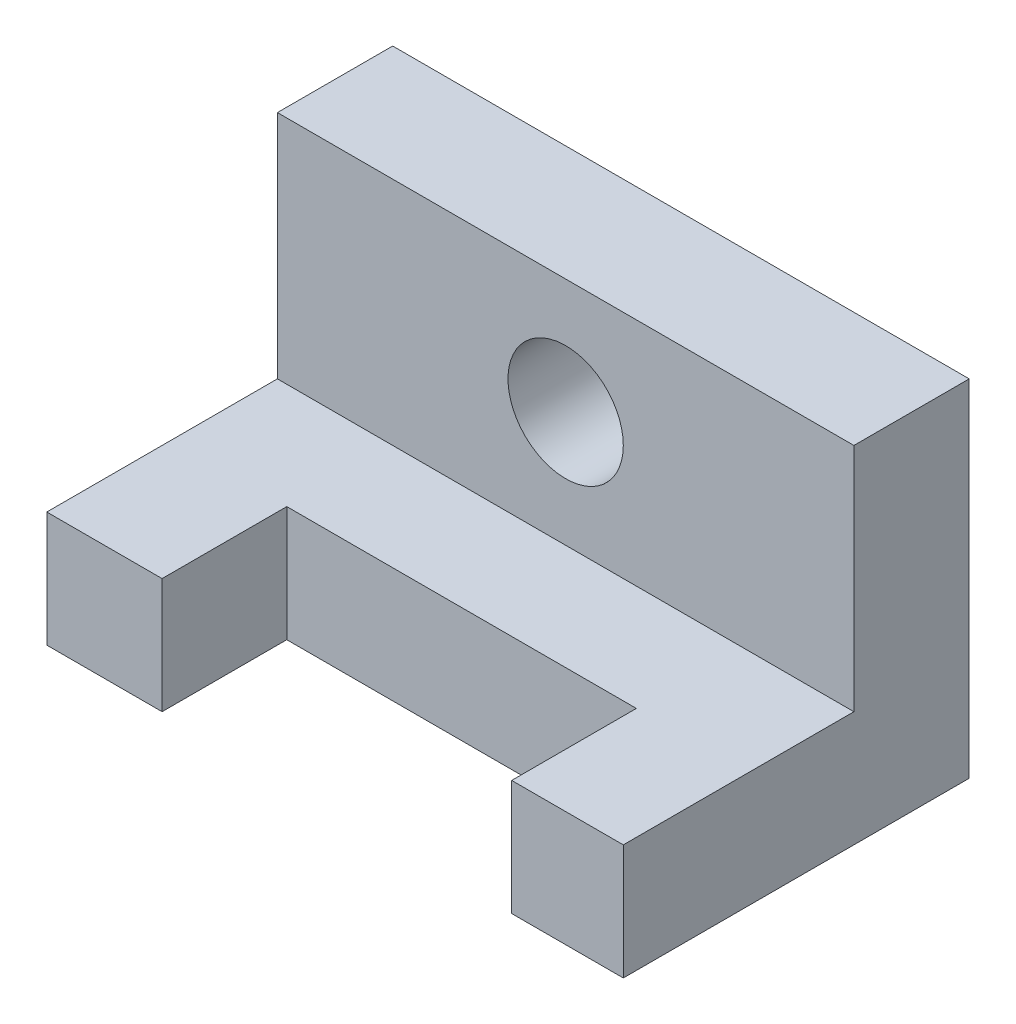
ISO-10303-21;
HEADER;
FILE_DESCRIPTION(('STEP AP214'),'2;1');
FILE_NAME('part.step','',(''),(''),'','','');
FILE_SCHEMA(('AUTOMOTIVE_DESIGN { 1 0 10303 214 1 1 1 1 }'));
ENDSEC;
DATA;
#1=APPLICATION_CONTEXT('core data for automotive mechanical design processes');
#2=APPLICATION_PROTOCOL_DEFINITION('international standard','automotive_design',2000,#1);
#3=PRODUCT_CONTEXT('',#1,'mechanical');
#4=PRODUCT('Part','Part','',(#3));
#5=PRODUCT_RELATED_PRODUCT_CATEGORY('part','',(#4));
#6=PRODUCT_DEFINITION_FORMATION('','',#4);
#7=PRODUCT_DEFINITION_CONTEXT('part definition',#1,'design');
#8=PRODUCT_DEFINITION('design','',#6,#7);
#9=PRODUCT_DEFINITION_SHAPE('','',#8);
#10=(LENGTH_UNIT() NAMED_UNIT(*) SI_UNIT(.MILLI.,.METRE.));
#11=(NAMED_UNIT(*) PLANE_ANGLE_UNIT() SI_UNIT($,.RADIAN.));
#12=(NAMED_UNIT(*) SI_UNIT($,.STERADIAN.) SOLID_ANGLE_UNIT());
#13=UNCERTAINTY_MEASURE_WITH_UNIT(LENGTH_MEASURE(1.E-05),#10,'distance_accuracy_value','');
#14=(GEOMETRIC_REPRESENTATION_CONTEXT(3) GLOBAL_UNCERTAINTY_ASSIGNED_CONTEXT((#13)) GLOBAL_UNIT_ASSIGNED_CONTEXT((#10,
#11,#12)) REPRESENTATION_CONTEXT('',''));
#15=CARTESIAN_POINT('',(0.,0.,0.));
#16=DIRECTION('',(0.,0.,1.));
#17=DIRECTION('',(1.,0.,0.));
#18=AXIS2_PLACEMENT_3D('',#15,#16,#17);
#19=CARTESIAN_POINT('',(2540.,508.,1524.));
#20=DIRECTION('',(0.,-1.,0.));
#21=DIRECTION('',(0.,0.,-1.));
#22=AXIS2_PLACEMENT_3D('',#19,#20,#21);
#23=PLANE('',#22);
#24=DIRECTION('',(0.,0.,1.));
#25=VECTOR('',#24,1.);
#26=CARTESIAN_POINT('',(508.,508.,974.657047921594));
#27=LINE('',#26,#25);
#28=CARTESIAN_POINT('',(508.,508.,974.657047921594));
#29=VERTEX_POINT('',#28);
#30=CARTESIAN_POINT('',(508.,508.,1524.));
#31=VERTEX_POINT('',#30);
#32=EDGE_CURVE('E170',#29,#31,#27,.T.);
#33=ORIENTED_EDGE('',*,*,#32,.F.);
#34=DIRECTION('',(-1.,0.,0.));
#35=VECTOR('',#34,1.);
#36=CARTESIAN_POINT('',(508.,508.,974.657047921594));
#37=LINE('',#36,#35);
#38=CARTESIAN_POINT('',(2048.2343030322,508.,974.657047921594));
#39=VERTEX_POINT('',#38);
#40=EDGE_CURVE('E239',#39,#29,#37,.T.);
#41=ORIENTED_EDGE('',*,*,#40,.F.);
#42=DIRECTION('',(0.,0.,-1.));
#43=VECTOR('',#42,1.);
#44=CARTESIAN_POINT('',(2048.2343030322,508.,974.657047921594));
#45=LINE('',#44,#43);
#46=CARTESIAN_POINT('',(2048.2343030322,508.,1524.));
#47=VERTEX_POINT('',#46);
#48=EDGE_CURVE('E125',#47,#39,#45,.T.);
#49=ORIENTED_EDGE('',*,*,#48,.F.);
#50=DIRECTION('',(-1.,0.,0.));
#51=VECTOR('',#50,1.);
#52=CARTESIAN_POINT('',(2540.,508.,1524.));
#53=LINE('',#52,#51);
#54=CARTESIAN_POINT('',(2540.,508.,1524.));
#55=VERTEX_POINT('',#54);
#56=EDGE_CURVE('E120',#55,#47,#53,.T.);
#57=ORIENTED_EDGE('',*,*,#56,.F.);
#58=DIRECTION('',(0.,0.,1.));
#59=VECTOR('',#58,1.);
#60=CARTESIAN_POINT('',(2540.,508.,1524.));
#61=LINE('',#60,#59);
#62=CARTESIAN_POINT('',(2540.,508.,508.));
#63=VERTEX_POINT('',#62);
#64=EDGE_CURVE('E106',#63,#55,#61,.T.);
#65=ORIENTED_EDGE('',*,*,#64,.F.);
#66=DIRECTION('',(-1.,0.,0.));
#67=VECTOR('',#66,1.);
#68=CARTESIAN_POINT('',(2540.,508.,508.));
#69=LINE('',#68,#67);
#70=CARTESIAN_POINT('',(0.,508.,508.));
#71=VERTEX_POINT('',#70);
#72=EDGE_CURVE('E128',#63,#71,#69,.T.);
#73=ORIENTED_EDGE('',*,*,#72,.T.);
#74=DIRECTION('',(0.,0.,1.));
#75=VECTOR('',#74,1.);
#76=CARTESIAN_POINT('',(0.,508.,1524.));
#77=LINE('',#76,#75);
#78=CARTESIAN_POINT('',(0.,508.,1524.));
#79=VERTEX_POINT('',#78);
#80=EDGE_CURVE('E147',#71,#79,#77,.T.);
#81=ORIENTED_EDGE('',*,*,#80,.T.);
#82=EDGE_CURVE('E129',#31,#79,#53,.T.);
#83=ORIENTED_EDGE('',*,*,#82,.F.);
#84=EDGE_LOOP('',(#33,#41,#49,#57,#65,#73,#81,#83));
#85=FACE_BOUND('',#84,.T.);
#86=ADVANCED_FACE('F38',(#85),#23,.F.);
#87=CARTESIAN_POINT('',(2540.,0.,1524.));
#88=DIRECTION('',(0.,0.,-1.));
#89=DIRECTION('',(-1.,0.,0.));
#90=AXIS2_PLACEMENT_3D('',#87,#88,#89);
#91=PLANE('',#90);
#92=DIRECTION('',(0.,-1.,0.));
#93=VECTOR('',#92,1.);
#94=CARTESIAN_POINT('',(508.,508.,1524.));
#95=LINE('',#94,#93);
#96=CARTESIAN_POINT('',(508.,0.,1524.));
#97=VERTEX_POINT('',#96);
#98=EDGE_CURVE('E143',#31,#97,#95,.T.);
#99=ORIENTED_EDGE('',*,*,#98,.F.);
#100=ORIENTED_EDGE('',*,*,#82,.T.);
#101=DIRECTION('',(0.,-1.,0.));
#102=VECTOR('',#101,1.);
#103=CARTESIAN_POINT('',(0.,0.,1524.));
#104=LINE('',#103,#102);
#105=CARTESIAN_POINT('',(0.,0.,1524.));
#106=VERTEX_POINT('',#105);
#107=EDGE_CURVE('E150',#79,#106,#104,.T.);
#108=ORIENTED_EDGE('',*,*,#107,.T.);
#109=DIRECTION('',(-1.,0.,0.));
#110=VECTOR('',#109,1.);
#111=CARTESIAN_POINT('',(2540.,0.,1524.));
#112=LINE('',#111,#110);
#113=EDGE_CURVE('E156',#97,#106,#112,.T.);
#114=ORIENTED_EDGE('',*,*,#113,.F.);
#115=EDGE_LOOP('',(#99,#100,#108,#114));
#116=FACE_BOUND('',#115,.T.);
#117=ADVANCED_FACE('F174',(#116),#91,.F.);
#118=DIRECTION('',(0.,-1.,0.));
#119=VECTOR('',#118,1.);
#120=CARTESIAN_POINT('',(2048.2343030322,508.,1524.));
#121=LINE('',#120,#119);
#122=CARTESIAN_POINT('',(2048.2343030322,0.,1524.));
#123=VERTEX_POINT('',#122);
#124=EDGE_CURVE('E177',#47,#123,#121,.T.);
#125=ORIENTED_EDGE('',*,*,#124,.T.);
#126=CARTESIAN_POINT('',(2540.,0.,1524.));
#127=VERTEX_POINT('',#126);
#128=EDGE_CURVE('E133',#127,#123,#112,.T.);
#129=ORIENTED_EDGE('',*,*,#128,.F.);
#130=DIRECTION('',(0.,-1.,0.));
#131=VECTOR('',#130,1.);
#132=CARTESIAN_POINT('',(2540.,0.,1524.));
#133=LINE('',#132,#131);
#134=EDGE_CURVE('E110',#55,#127,#133,.T.);
#135=ORIENTED_EDGE('',*,*,#134,.F.);
#136=ORIENTED_EDGE('',*,*,#56,.T.);
#137=EDGE_LOOP('',(#125,#129,#135,#136));
#138=FACE_BOUND('',#137,.T.);
#139=ADVANCED_FACE('F131',(#138),#91,.F.);
#140=CARTESIAN_POINT('',(2540.,0.,0.));
#141=DIRECTION('',(0.,1.,0.));
#142=DIRECTION('',(0.,0.,1.));
#143=AXIS2_PLACEMENT_3D('',#140,#141,#142);
#144=PLANE('',#143);
#145=DIRECTION('',(0.,0.,1.));
#146=VECTOR('',#145,1.);
#147=CARTESIAN_POINT('',(508.,0.,974.657047921594));
#148=LINE('',#147,#146);
#149=CARTESIAN_POINT('',(508.,0.,974.657047921594));
#150=VERTEX_POINT('',#149);
#151=EDGE_CURVE('E53',#150,#97,#148,.T.);
#152=ORIENTED_EDGE('',*,*,#151,.T.);
#153=ORIENTED_EDGE('',*,*,#113,.T.);
#154=DIRECTION('',(0.,0.,-1.));
#155=VECTOR('',#154,1.);
#156=CARTESIAN_POINT('',(0.,0.,0.));
#157=LINE('',#156,#155);
#158=CARTESIAN_POINT('',(0.,0.,0.));
#159=VERTEX_POINT('',#158);
#160=EDGE_CURVE('E88',#106,#159,#157,.T.);
#161=ORIENTED_EDGE('',*,*,#160,.T.);
#162=DIRECTION('',(-1.,0.,0.));
#163=VECTOR('',#162,1.);
#164=CARTESIAN_POINT('',(2540.,0.,0.));
#165=LINE('',#164,#163);
#166=CARTESIAN_POINT('',(2540.,0.,0.));
#167=VERTEX_POINT('',#166);
#168=EDGE_CURVE('E135',#167,#159,#165,.T.);
#169=ORIENTED_EDGE('',*,*,#168,.F.);
#170=DIRECTION('',(0.,0.,-1.));
#171=VECTOR('',#170,1.);
#172=CARTESIAN_POINT('',(2540.,0.,0.));
#173=LINE('',#172,#171);
#174=EDGE_CURVE('E62',#127,#167,#173,.T.);
#175=ORIENTED_EDGE('',*,*,#174,.F.);
#176=ORIENTED_EDGE('',*,*,#128,.T.);
#177=DIRECTION('',(0.,0.,-1.));
#178=VECTOR('',#177,1.);
#179=CARTESIAN_POINT('',(2048.2343030322,0.,974.657047921594));
#180=LINE('',#179,#178);
#181=CARTESIAN_POINT('',(2048.2343030322,0.,974.657047921594));
#182=VERTEX_POINT('',#181);
#183=EDGE_CURVE('E244',#123,#182,#180,.T.);
#184=ORIENTED_EDGE('',*,*,#183,.T.);
#185=DIRECTION('',(-1.,0.,0.));
#186=VECTOR('',#185,1.);
#187=CARTESIAN_POINT('',(508.,0.,974.657047921594));
#188=LINE('',#187,#186);
#189=EDGE_CURVE('E237',#182,#150,#188,.T.);
#190=ORIENTED_EDGE('',*,*,#189,.T.);
#191=EDGE_LOOP('',(#152,#153,#161,#169,#175,#176,#184,#190));
#192=FACE_BOUND('',#191,.T.);
#193=ADVANCED_FACE('F196',(#192),#144,.F.);
#194=CARTESIAN_POINT('',(2540.,0.,0.));
#195=DIRECTION('',(0.,0.,1.));
#196=DIRECTION('',(1.,0.,0.));
#197=AXIS2_PLACEMENT_3D('',#194,#195,#196);
#198=PLANE('',#197);
#199=CARTESIAN_POINT('',(1270.,1016.,0.));
#200=DIRECTION('',(0.,0.,1.));
#201=DIRECTION('',(1.,0.,0.));
#202=AXIS2_PLACEMENT_3D('',#199,#200,#201);
#203=CIRCLE('',#202,254.);
#204=CARTESIAN_POINT('',(1524.,1016.,0.));
#205=VERTEX_POINT('',#204);
#206=EDGE_CURVE('E232',#205,#205,#203,.T.);
#207=ORIENTED_EDGE('',*,*,#206,.T.);
#208=EDGE_LOOP('',(#207));
#209=FACE_BOUND('',#208,.T.);
#210=DIRECTION('',(0.,1.,0.));
#211=VECTOR('',#210,1.);
#212=CARTESIAN_POINT('',(0.,0.,0.));
#213=LINE('',#212,#211);
#214=CARTESIAN_POINT('',(0.,1524.,0.));
#215=VERTEX_POINT('',#214);
#216=EDGE_CURVE('E139',#159,#215,#213,.T.);
#217=ORIENTED_EDGE('',*,*,#216,.T.);
#218=DIRECTION('',(-1.,0.,0.));
#219=VECTOR('',#218,1.);
#220=CARTESIAN_POINT('',(2540.,1524.,0.));
#221=LINE('',#220,#219);
#222=CARTESIAN_POINT('',(2540.,1524.,0.));
#223=VERTEX_POINT('',#222);
#224=EDGE_CURVE('E11',#223,#215,#221,.T.);
#225=ORIENTED_EDGE('',*,*,#224,.F.);
#226=DIRECTION('',(0.,1.,0.));
#227=VECTOR('',#226,1.);
#228=CARTESIAN_POINT('',(2540.,0.,0.));
#229=LINE('',#228,#227);
#230=EDGE_CURVE('E154',#167,#223,#229,.T.);
#231=ORIENTED_EDGE('',*,*,#230,.F.);
#232=ORIENTED_EDGE('',*,*,#168,.T.);
#233=EDGE_LOOP('',(#217,#225,#231,#232));
#234=FACE_BOUND('',#233,.T.);
#235=ADVANCED_FACE('F40',(#209,#234),#198,.F.);
#236=CARTESIAN_POINT('',(2540.,1524.,0.));
#237=DIRECTION('',(0.,-1.,0.));
#238=DIRECTION('',(0.,0.,-1.));
#239=AXIS2_PLACEMENT_3D('',#236,#237,#238);
#240=PLANE('',#239);
#241=DIRECTION('',(0.,0.,1.));
#242=VECTOR('',#241,1.);
#243=CARTESIAN_POINT('',(0.,1524.,0.));
#244=LINE('',#243,#242);
#245=CARTESIAN_POINT('',(0.,1524.,508.));
#246=VERTEX_POINT('',#245);
#247=EDGE_CURVE('E142',#215,#246,#244,.T.);
#248=ORIENTED_EDGE('',*,*,#247,.T.);
#249=DIRECTION('',(-1.,0.,0.));
#250=VECTOR('',#249,1.);
#251=CARTESIAN_POINT('',(2540.,1524.,508.));
#252=LINE('',#251,#250);
#253=CARTESIAN_POINT('',(2540.,1524.,508.));
#254=VERTEX_POINT('',#253);
#255=EDGE_CURVE('E46',#254,#246,#252,.T.);
#256=ORIENTED_EDGE('',*,*,#255,.F.);
#257=DIRECTION('',(0.,0.,1.));
#258=VECTOR('',#257,1.);
#259=CARTESIAN_POINT('',(2540.,1524.,0.));
#260=LINE('',#259,#258);
#261=EDGE_CURVE('E96',#223,#254,#260,.T.);
#262=ORIENTED_EDGE('',*,*,#261,.F.);
#263=ORIENTED_EDGE('',*,*,#224,.T.);
#264=EDGE_LOOP('',(#248,#256,#262,#263));
#265=FACE_BOUND('',#264,.T.);
#266=ADVANCED_FACE('F187',(#265),#240,.F.);
#267=CARTESIAN_POINT('',(2540.,1524.,508.));
#268=DIRECTION('',(0.,0.,-1.));
#269=DIRECTION('',(-1.,0.,0.));
#270=AXIS2_PLACEMENT_3D('',#267,#268,#269);
#271=PLANE('',#270);
#272=CARTESIAN_POINT('',(1270.,1016.,508.));
#273=DIRECTION('',(0.,0.,1.));
#274=DIRECTION('',(1.,0.,0.));
#275=AXIS2_PLACEMENT_3D('',#272,#273,#274);
#276=CIRCLE('',#275,254.);
#277=CARTESIAN_POINT('',(1524.,1016.,508.));
#278=VERTEX_POINT('',#277);
#279=EDGE_CURVE('E229',#278,#278,#276,.T.);
#280=ORIENTED_EDGE('',*,*,#279,.F.);
#281=EDGE_LOOP('',(#280));
#282=FACE_BOUND('',#281,.T.);
#283=DIRECTION('',(0.,-1.,0.));
#284=VECTOR('',#283,1.);
#285=CARTESIAN_POINT('',(0.,1524.,508.));
#286=LINE('',#285,#284);
#287=EDGE_CURVE('E145',#246,#71,#286,.T.);
#288=ORIENTED_EDGE('',*,*,#287,.T.);
#289=ORIENTED_EDGE('',*,*,#72,.F.);
#290=DIRECTION('',(0.,-1.,0.));
#291=VECTOR('',#290,1.);
#292=CARTESIAN_POINT('',(2540.,1524.,508.));
#293=LINE('',#292,#291);
#294=EDGE_CURVE('E113',#254,#63,#293,.T.);
#295=ORIENTED_EDGE('',*,*,#294,.F.);
#296=ORIENTED_EDGE('',*,*,#255,.T.);
#297=EDGE_LOOP('',(#288,#289,#295,#296));
#298=FACE_BOUND('',#297,.T.);
#299=ADVANCED_FACE('F161',(#282,#298),#271,.F.);
#300=CARTESIAN_POINT('',(2540.,0.,0.));
#301=DIRECTION('',(1.,0.,0.));
#302=DIRECTION('',(0.,0.,-1.));
#303=AXIS2_PLACEMENT_3D('',#300,#301,#302);
#304=PLANE('',#303);
#305=ORIENTED_EDGE('',*,*,#230,.T.);
#306=ORIENTED_EDGE('',*,*,#261,.T.);
#307=ORIENTED_EDGE('',*,*,#294,.T.);
#308=ORIENTED_EDGE('',*,*,#64,.T.);
#309=ORIENTED_EDGE('',*,*,#134,.T.);
#310=ORIENTED_EDGE('',*,*,#174,.T.);
#311=EDGE_LOOP('',(#305,#306,#307,#308,#309,#310));
#312=FACE_BOUND('',#311,.T.);
#313=ADVANCED_FACE('F108',(#312),#304,.T.);
#314=CARTESIAN_POINT('',(0.,0.,0.));
#315=DIRECTION('',(1.,0.,0.));
#316=DIRECTION('',(0.,0.,-1.));
#317=AXIS2_PLACEMENT_3D('',#314,#315,#316);
#318=PLANE('',#317);
#319=ORIENTED_EDGE('',*,*,#216,.F.);
#320=ORIENTED_EDGE('',*,*,#160,.F.);
#321=ORIENTED_EDGE('',*,*,#107,.F.);
#322=ORIENTED_EDGE('',*,*,#80,.F.);
#323=ORIENTED_EDGE('',*,*,#287,.F.);
#324=ORIENTED_EDGE('',*,*,#247,.F.);
#325=EDGE_LOOP('',(#319,#320,#321,#322,#323,#324));
#326=FACE_BOUND('',#325,.T.);
#327=ADVANCED_FACE('F165',(#326),#318,.F.);
#328=CARTESIAN_POINT('',(508.,508.,974.657047921594));
#329=DIRECTION('',(1.,0.,0.));
#330=DIRECTION('',(0.,0.,-1.));
#331=AXIS2_PLACEMENT_3D('',#328,#329,#330);
#332=PLANE('',#331);
#333=ORIENTED_EDGE('',*,*,#151,.F.);
#334=DIRECTION('',(0.,-1.,0.));
#335=VECTOR('',#334,1.);
#336=CARTESIAN_POINT('',(508.,508.,974.657047921594));
#337=LINE('',#336,#335);
#338=EDGE_CURVE('E242',#29,#150,#337,.T.);
#339=ORIENTED_EDGE('',*,*,#338,.F.);
#340=ORIENTED_EDGE('',*,*,#32,.T.);
#341=ORIENTED_EDGE('',*,*,#98,.T.);
#342=EDGE_LOOP('',(#333,#339,#340,#341));
#343=FACE_BOUND('',#342,.T.);
#344=ADVANCED_FACE('F209',(#343),#332,.T.);
#345=CARTESIAN_POINT('',(2048.2343030322,508.,974.657047921594));
#346=DIRECTION('',(-1.,0.,0.));
#347=DIRECTION('',(0.,0.,1.));
#348=AXIS2_PLACEMENT_3D('',#345,#346,#347);
#349=PLANE('',#348);
#350=ORIENTED_EDGE('',*,*,#183,.F.);
#351=ORIENTED_EDGE('',*,*,#124,.F.);
#352=ORIENTED_EDGE('',*,*,#48,.T.);
#353=DIRECTION('',(0.,-1.,0.));
#354=VECTOR('',#353,1.);
#355=CARTESIAN_POINT('',(2048.2343030322,508.,974.657047921594));
#356=LINE('',#355,#354);
#357=EDGE_CURVE('E179',#39,#182,#356,.T.);
#358=ORIENTED_EDGE('',*,*,#357,.T.);
#359=EDGE_LOOP('',(#350,#351,#352,#358));
#360=FACE_BOUND('',#359,.T.);
#361=ADVANCED_FACE('F213',(#360),#349,.T.);
#362=CARTESIAN_POINT('',(508.,508.,974.657047921594));
#363=DIRECTION('',(0.,0.,1.));
#364=DIRECTION('',(1.,0.,0.));
#365=AXIS2_PLACEMENT_3D('',#362,#363,#364);
#366=PLANE('',#365);
#367=ORIENTED_EDGE('',*,*,#189,.F.);
#368=ORIENTED_EDGE('',*,*,#357,.F.);
#369=ORIENTED_EDGE('',*,*,#40,.T.);
#370=ORIENTED_EDGE('',*,*,#338,.T.);
#371=EDGE_LOOP('',(#367,#368,#369,#370));
#372=FACE_BOUND('',#371,.T.);
#373=ADVANCED_FACE('F216',(#372),#366,.T.);
#374=CARTESIAN_POINT('',(1270.,1016.,508.));
#375=DIRECTION('',(0.,0.,-1.));
#376=DIRECTION('',(-1.,0.,0.));
#377=AXIS2_PLACEMENT_3D('',#374,#375,#376);
#378=CYLINDRICAL_SURFACE('',#377,254.);
#379=ORIENTED_EDGE('',*,*,#279,.T.);
#380=EDGE_LOOP('',(#379));
#381=FACE_BOUND('',#380,.T.);
#382=ORIENTED_EDGE('',*,*,#206,.F.);
#383=EDGE_LOOP('',(#382));
#384=FACE_BOUND('',#383,.T.);
#385=ADVANCED_FACE('F220',(#381,#384),#378,.F.);
#386=CLOSED_SHELL('',(#86,#117,#139,#193,#235,#266,#299,#313,#327,#344,#361,#373,#385));
#387=MANIFOLD_SOLID_BREP('B2',#386);
#388=ADVANCED_BREP_SHAPE_REPRESENTATION('',(#18,#387),#14);
#389=SHAPE_DEFINITION_REPRESENTATION(#9,#388);
ENDSEC;
END-ISO-10303-21;
